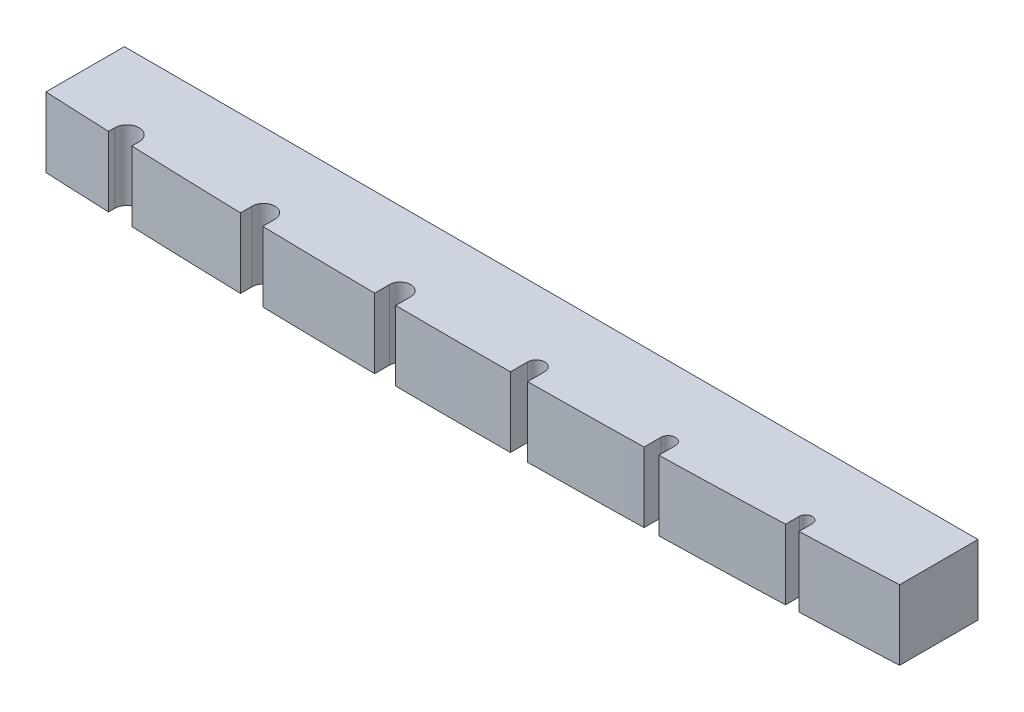
ISO-10303-21;
HEADER;
FILE_DESCRIPTION(('STEP AP214'),'2;1');
FILE_NAME('part.step','',(''),(''),'','','');
FILE_SCHEMA(('AUTOMOTIVE_DESIGN { 1 0 10303 214 1 1 1 1 }'));
ENDSEC;
DATA;
#1=APPLICATION_CONTEXT('core data for automotive mechanical design processes');
#2=APPLICATION_PROTOCOL_DEFINITION('international standard','automotive_design',2000,#1);
#3=PRODUCT_CONTEXT('',#1,'mechanical');
#4=PRODUCT('Part','Part','',(#3));
#5=PRODUCT_RELATED_PRODUCT_CATEGORY('part','',(#4));
#6=PRODUCT_DEFINITION_FORMATION('','',#4);
#7=PRODUCT_DEFINITION_CONTEXT('part definition',#1,'design');
#8=PRODUCT_DEFINITION('design','',#6,#7);
#9=PRODUCT_DEFINITION_SHAPE('','',#8);
#10=(LENGTH_UNIT() NAMED_UNIT(*) SI_UNIT(.MILLI.,.METRE.));
#11=(NAMED_UNIT(*) PLANE_ANGLE_UNIT() SI_UNIT($,.RADIAN.));
#12=(NAMED_UNIT(*) SI_UNIT($,.STERADIAN.) SOLID_ANGLE_UNIT());
#13=UNCERTAINTY_MEASURE_WITH_UNIT(LENGTH_MEASURE(1.E-05),#10,'distance_accuracy_value','');
#14=(GEOMETRIC_REPRESENTATION_CONTEXT(3) GLOBAL_UNCERTAINTY_ASSIGNED_CONTEXT((#13)) GLOBAL_UNIT_ASSIGNED_CONTEXT((#10,
#11,#12)) REPRESENTATION_CONTEXT('',''));
#15=CARTESIAN_POINT('',(0.,0.,0.));
#16=DIRECTION('',(0.,0.,1.));
#17=DIRECTION('',(1.,0.,0.));
#18=AXIS2_PLACEMENT_3D('',#15,#16,#17);
#19=CARTESIAN_POINT('',(0.,3.429,0.));
#20=DIRECTION('',(1.,0.,0.));
#21=DIRECTION('',(0.,0.,-1.));
#22=AXIS2_PLACEMENT_3D('',#19,#20,#21);
#23=PLANE('',#22);
#24=DIRECTION('',(0.,0.,1.));
#25=VECTOR('',#24,1.);
#26=CARTESIAN_POINT('',(0.,0.,0.));
#27=LINE('',#26,#25);
#28=CARTESIAN_POINT('',(0.,0.,-4.3561));
#29=VERTEX_POINT('',#28);
#30=CARTESIAN_POINT('',(0.,0.,-0.508));
#31=VERTEX_POINT('',#30);
#32=EDGE_CURVE('E229',#29,#31,#27,.T.);
#33=ORIENTED_EDGE('',*,*,#32,.T.);
#34=DIRECTION('',(0.,1.,0.));
#35=VECTOR('',#34,1.);
#36=CARTESIAN_POINT('',(0.,-0.00100000000000013,-0.508));
#37=LINE('',#36,#35);
#38=CARTESIAN_POINT('',(0.,3.429,-0.508));
#39=VERTEX_POINT('',#38);
#40=EDGE_CURVE('E215',#31,#39,#37,.T.);
#41=ORIENTED_EDGE('',*,*,#40,.T.);
#42=DIRECTION('',(0.,0.,1.));
#43=VECTOR('',#42,1.);
#44=CARTESIAN_POINT('',(0.,3.429,0.));
#45=LINE('',#44,#43);
#46=CARTESIAN_POINT('',(0.,3.429,-4.3561));
#47=VERTEX_POINT('',#46);
#48=EDGE_CURVE('E246',#47,#39,#45,.T.);
#49=ORIENTED_EDGE('',*,*,#48,.F.);
#50=DIRECTION('',(0.,-1.,0.));
#51=VECTOR('',#50,1.);
#52=CARTESIAN_POINT('',(0.,3.429,-4.3561));
#53=LINE('',#52,#51);
#54=EDGE_CURVE('E40',#47,#29,#53,.T.);
#55=ORIENTED_EDGE('',*,*,#54,.T.);
#56=EDGE_LOOP('',(#33,#41,#49,#55));
#57=FACE_BOUND('',#56,.T.);
#58=ADVANCED_FACE('F33',(#57),#23,.F.);
#59=CARTESIAN_POINT('',(41.91,3.429,0.));
#60=DIRECTION('',(-1.,0.,0.));
#61=DIRECTION('',(0.,0.,1.));
#62=AXIS2_PLACEMENT_3D('',#59,#60,#61);
#63=PLANE('',#62);
#64=DIRECTION('',(0.,0.,-1.));
#65=VECTOR('',#64,1.);
#66=CARTESIAN_POINT('',(41.91,3.429,0.));
#67=LINE('',#66,#65);
#68=CARTESIAN_POINT('',(41.91,3.429,-0.508));
#69=VERTEX_POINT('',#68);
#70=CARTESIAN_POINT('',(41.91,3.429,-4.3561));
#71=VERTEX_POINT('',#70);
#72=EDGE_CURVE('E247',#69,#71,#67,.T.);
#73=ORIENTED_EDGE('',*,*,#72,.F.);
#74=DIRECTION('',(0.,1.,0.));
#75=VECTOR('',#74,1.);
#76=CARTESIAN_POINT('',(41.91,-0.00100000000000013,-0.508));
#77=LINE('',#76,#75);
#78=CARTESIAN_POINT('',(41.91,0.,-0.508));
#79=VERTEX_POINT('',#78);
#80=EDGE_CURVE('E416',#79,#69,#77,.T.);
#81=ORIENTED_EDGE('',*,*,#80,.F.);
#82=DIRECTION('',(0.,0.,-1.));
#83=VECTOR('',#82,1.);
#84=CARTESIAN_POINT('',(41.91,0.,0.));
#85=LINE('',#84,#83);
#86=CARTESIAN_POINT('',(41.91,0.,-4.3561));
#87=VERTEX_POINT('',#86);
#88=EDGE_CURVE('E236',#79,#87,#85,.T.);
#89=ORIENTED_EDGE('',*,*,#88,.T.);
#90=DIRECTION('',(0.,-1.,0.));
#91=VECTOR('',#90,1.);
#92=CARTESIAN_POINT('',(41.91,3.429,-4.3561));
#93=LINE('',#92,#91);
#94=EDGE_CURVE('E11',#71,#87,#93,.T.);
#95=ORIENTED_EDGE('',*,*,#94,.F.);
#96=EDGE_LOOP('',(#73,#81,#89,#95));
#97=FACE_BOUND('',#96,.T.);
#98=ADVANCED_FACE('F537',(#97),#63,.F.);
#99=CARTESIAN_POINT('',(0.,3.429,-4.3561));
#100=DIRECTION('',(0.,0.,1.));
#101=DIRECTION('',(1.,0.,0.));
#102=AXIS2_PLACEMENT_3D('',#99,#100,#101);
#103=PLANE('',#102);
#104=DIRECTION('',(-1.,0.,0.));
#105=VECTOR('',#104,1.);
#106=CARTESIAN_POINT('',(0.,0.,-4.3561));
#107=LINE('',#106,#105);
#108=EDGE_CURVE('E238',#87,#29,#107,.T.);
#109=ORIENTED_EDGE('',*,*,#108,.T.);
#110=ORIENTED_EDGE('',*,*,#54,.F.);
#111=DIRECTION('',(-1.,0.,0.));
#112=VECTOR('',#111,1.);
#113=CARTESIAN_POINT('',(0.,3.429,-4.3561));
#114=LINE('',#113,#112);
#115=EDGE_CURVE('E243',#71,#47,#114,.T.);
#116=ORIENTED_EDGE('',*,*,#115,.F.);
#117=ORIENTED_EDGE('',*,*,#94,.T.);
#118=EDGE_LOOP('',(#109,#110,#116,#117));
#119=FACE_BOUND('',#118,.T.);
#120=ADVANCED_FACE('F539',(#119),#103,.F.);
#121=CARTESIAN_POINT('',(0.,3.429,0.));
#122=DIRECTION('',(0.,-1.,0.));
#123=DIRECTION('',(0.,0.,-1.));
#124=AXIS2_PLACEMENT_3D('',#121,#122,#123);
#125=PLANE('',#124);
#126=ORIENTED_EDGE('',*,*,#48,.T.);
#127=CARTESIAN_POINT('',(20.955,3.429,-432.450875000121));
#128=DIRECTION('',(0.,-1.,0.));
#129=DIRECTION('',(0.,0.,1.));
#130=AXIS2_PLACEMENT_3D('',#127,#128,#129);
#131=CIRCLE('',#130,432.45087500012);
#132=CARTESIAN_POINT('',(3.21310000000003,3.429,-0.364096363282662));
#133=VERTEX_POINT('',#132);
#134=EDGE_CURVE('E218',#133,#39,#131,.T.);
#135=ORIENTED_EDGE('',*,*,#134,.F.);
#136=DIRECTION('',(0.,0.,1.));
#137=VECTOR('',#136,1.);
#138=CARTESIAN_POINT('',(3.2131,3.429,0.));
#139=LINE('',#138,#137);
#140=CARTESIAN_POINT('',(3.21310000000005,3.429,-0.673406364672869));
#141=VERTEX_POINT('',#140);
#142=EDGE_CURVE('E263',#141,#133,#139,.T.);
#143=ORIENTED_EDGE('',*,*,#142,.F.);
#144=CARTESIAN_POINT('',(3.81000024084542,3.429,-0.673099759154534));
#145=DIRECTION('',(0.,1.,0.));
#146=DIRECTION('',(0.,0.,-1.));
#147=AXIS2_PLACEMENT_3D('',#144,#145,#146);
#148=CIRCLE('',#147,0.596900319591282);
#149=CARTESIAN_POINT('',(4.40690048169086,3.429,-0.672793153825247));
#150=VERTEX_POINT('',#149);
#151=EDGE_CURVE('E266',#150,#141,#148,.T.);
#152=ORIENTED_EDGE('',*,*,#151,.F.);
#153=DIRECTION('',(0.,0.,-1.));
#154=VECTOR('',#153,1.);
#155=CARTESIAN_POINT('',(4.40690048169084,3.429,0.));
#156=LINE('',#155,#154);
#157=CARTESIAN_POINT('',(4.40690048169084,3.429,-0.316729518995806));
#158=VERTEX_POINT('',#157);
#159=EDGE_CURVE('E264',#158,#150,#156,.T.);
#160=ORIENTED_EDGE('',*,*,#159,.F.);
#161=CARTESIAN_POINT('',(20.955,3.429,-432.450875000121));
#162=DIRECTION('',(0.,-1.,0.));
#163=DIRECTION('',(0.,0.,1.));
#164=AXIS2_PLACEMENT_3D('',#161,#162,#163);
#165=CIRCLE('',#164,432.45087500012);
#166=CARTESIAN_POINT('',(9.91870048169088,3.429,-0.140848073480859));
#167=VERTEX_POINT('',#166);
#168=EDGE_CURVE('E372',#167,#158,#165,.T.);
#169=ORIENTED_EDGE('',*,*,#168,.F.);
#170=DIRECTION('',(0.,0.,1.));
#171=VECTOR('',#170,1.);
#172=CARTESIAN_POINT('',(9.91870048169088,3.429,0.));
#173=LINE('',#172,#171);
#174=CARTESIAN_POINT('',(9.91870048169088,3.429,-0.7112));
#175=VERTEX_POINT('',#174);
#176=EDGE_CURVE('E284',#175,#167,#173,.T.);
#177=ORIENTED_EDGE('',*,*,#176,.F.);
#178=CARTESIAN_POINT('',(10.4775004816909,3.429,-0.7112));
#179=DIRECTION('',(0.,1.,0.));
#180=DIRECTION('',(0.,0.,-1.));
#181=AXIS2_PLACEMENT_3D('',#178,#179,#180);
#182=CIRCLE('',#181,0.5588);
#183=CARTESIAN_POINT('',(11.0363004816909,3.429,-0.7112));
#184=VERTEX_POINT('',#183);
#185=EDGE_CURVE('E287',#184,#175,#182,.T.);
#186=ORIENTED_EDGE('',*,*,#185,.F.);
#187=DIRECTION('',(0.,0.,-1.));
#188=VECTOR('',#187,1.);
#189=CARTESIAN_POINT('',(11.0363004816909,3.429,0.));
#190=LINE('',#189,#188);
#191=CARTESIAN_POINT('',(11.0363004816909,3.429,-0.113762681232032));
#192=VERTEX_POINT('',#191);
#193=EDGE_CURVE('E285',#192,#184,#190,.T.);
#194=ORIENTED_EDGE('',*,*,#193,.F.);
#195=CARTESIAN_POINT('',(20.955,3.429,-432.450875000121));
#196=DIRECTION('',(0.,-1.,0.));
#197=DIRECTION('',(0.,0.,1.));
#198=AXIS2_PLACEMENT_3D('',#195,#196,#197);
#199=CIRCLE('',#198,432.45087500012);
#200=CARTESIAN_POINT('',(16.6243004816909,3.429,-0.021685039438224));
#201=VERTEX_POINT('',#200);
#202=EDGE_CURVE('E393',#201,#192,#199,.T.);
#203=ORIENTED_EDGE('',*,*,#202,.F.);
#204=DIRECTION('',(0.,0.,1.));
#205=VECTOR('',#204,1.);
#206=CARTESIAN_POINT('',(16.6243004816909,3.429,0.));
#207=LINE('',#206,#205);
#208=CARTESIAN_POINT('',(16.6243004816909,3.429,-0.749300000000001));
#209=VERTEX_POINT('',#208);
#210=EDGE_CURVE('E305',#209,#201,#207,.T.);
#211=ORIENTED_EDGE('',*,*,#210,.F.);
#212=CARTESIAN_POINT('',(17.1450004816909,3.429,-0.749300000000001));
#213=DIRECTION('',(0.,1.,0.));
#214=DIRECTION('',(0.,0.,-1.));
#215=AXIS2_PLACEMENT_3D('',#212,#213,#214);
#216=CIRCLE('',#215,0.520699999999999);
#217=CARTESIAN_POINT('',(17.6657004816909,3.429,-0.749300000000001));
#218=VERTEX_POINT('',#217);
#219=EDGE_CURVE('E308',#218,#209,#216,.T.);
#220=ORIENTED_EDGE('',*,*,#219,.F.);
#221=DIRECTION('',(0.,0.,-1.));
#222=VECTOR('',#221,1.);
#223=CARTESIAN_POINT('',(17.6657004816909,3.429,0.));
#224=LINE('',#223,#222);
#225=CARTESIAN_POINT('',(17.6657004816909,3.429,-0.0125096842659156));
#226=VERTEX_POINT('',#225);
#227=EDGE_CURVE('E306',#226,#218,#224,.T.);
#228=ORIENTED_EDGE('',*,*,#227,.F.);
#229=CARTESIAN_POINT('',(20.955,3.429,-432.450875000121));
#230=DIRECTION('',(0.,-1.,0.));
#231=DIRECTION('',(0.,0.,1.));
#232=AXIS2_PLACEMENT_3D('',#229,#230,#231);
#233=CIRCLE('',#232,432.45087500012);
#234=CARTESIAN_POINT('',(23.3045004816909,3.429,-0.00638245124290338));
#235=VERTEX_POINT('',#234);
#236=EDGE_CURVE('E386',#235,#226,#233,.T.);
#237=ORIENTED_EDGE('',*,*,#236,.F.);
#238=DIRECTION('',(0.,0.,1.));
#239=VECTOR('',#238,1.);
#240=CARTESIAN_POINT('',(23.3045004816909,3.429,0.));
#241=LINE('',#240,#239);
#242=CARTESIAN_POINT('',(23.3045004816909,3.429,-0.850899999999998));
#243=VERTEX_POINT('',#242);
#244=EDGE_CURVE('E326',#243,#235,#241,.T.);
#245=ORIENTED_EDGE('',*,*,#244,.F.);
#246=CARTESIAN_POINT('',(23.7236004816909,3.429,-0.850899999999998));
#247=DIRECTION('',(0.,1.,0.));
#248=DIRECTION('',(0.,0.,-1.));
#249=AXIS2_PLACEMENT_3D('',#246,#247,#248);
#250=CIRCLE('',#249,0.419099999999999);
#251=CARTESIAN_POINT('',(24.1427004816909,3.429,-0.850899999999998));
#252=VERTEX_POINT('',#251);
#253=EDGE_CURVE('E329',#252,#243,#250,.T.);
#254=ORIENTED_EDGE('',*,*,#253,.F.);
#255=DIRECTION('',(0.,0.,-1.));
#256=VECTOR('',#255,1.);
#257=CARTESIAN_POINT('',(24.1427004816909,3.429,0.));
#258=LINE('',#257,#256);
#259=CARTESIAN_POINT('',(24.1427004816909,3.429,-0.0117488170139901));
#260=VERTEX_POINT('',#259);
#261=EDGE_CURVE('E327',#260,#252,#258,.T.);
#262=ORIENTED_EDGE('',*,*,#261,.F.);
#263=CARTESIAN_POINT('',(20.955,3.429,-432.450875000121));
#264=DIRECTION('',(0.,-1.,0.));
#265=DIRECTION('',(0.,0.,1.));
#266=AXIS2_PLACEMENT_3D('',#263,#264,#265);
#267=CIRCLE('',#266,432.45087500012);
#268=CARTESIAN_POINT('',(29.7815004816909,3.429,-0.0900856382538562));
#269=VERTEX_POINT('',#268);
#270=EDGE_CURVE('E405',#269,#260,#267,.T.);
#271=ORIENTED_EDGE('',*,*,#270,.F.);
#272=DIRECTION('',(0.,0.,1.));
#273=VECTOR('',#272,1.);
#274=CARTESIAN_POINT('',(29.7815004816909,3.429,0.));
#275=LINE('',#274,#273);
#276=CARTESIAN_POINT('',(29.7815004816909,3.429,-0.914400000000003));
#277=VERTEX_POINT('',#276);
#278=EDGE_CURVE('E347',#277,#269,#275,.T.);
#279=ORIENTED_EDGE('',*,*,#278,.F.);
#280=CARTESIAN_POINT('',(30.1371004816909,3.429,-0.914400000000003));
#281=DIRECTION('',(0.,1.,0.));
#282=DIRECTION('',(0.,0.,-1.));
#283=AXIS2_PLACEMENT_3D('',#280,#281,#282);
#284=CIRCLE('',#283,0.355599999999998);
#285=CARTESIAN_POINT('',(30.4927004816909,3.429,-0.914400000000003));
#286=VERTEX_POINT('',#285);
#287=EDGE_CURVE('E350',#286,#277,#284,.T.);
#288=ORIENTED_EDGE('',*,*,#287,.F.);
#289=DIRECTION('',(0.,0.,-1.));
#290=VECTOR('',#289,1.);
#291=CARTESIAN_POINT('',(30.4927004816909,3.429,0.));
#292=LINE('',#291,#290);
#293=CARTESIAN_POINT('',(30.4927004816909,3.429,-0.105189745958079));
#294=VERTEX_POINT('',#293);
#295=EDGE_CURVE('E348',#294,#286,#292,.T.);
#296=ORIENTED_EDGE('',*,*,#295,.F.);
#297=CARTESIAN_POINT('',(20.955,3.429,-432.450875000121));
#298=DIRECTION('',(0.,-1.,0.));
#299=DIRECTION('',(0.,0.,1.));
#300=AXIS2_PLACEMENT_3D('',#297,#298,#299);
#301=CIRCLE('',#300,432.45087500012);
#302=CARTESIAN_POINT('',(36.5379004816909,3.429,-0.280847694955066));
#303=VERTEX_POINT('',#302);
#304=EDGE_CURVE('E423',#303,#294,#301,.T.);
#305=ORIENTED_EDGE('',*,*,#304,.F.);
#306=DIRECTION('',(0.,0.,1.));
#307=VECTOR('',#306,1.);
#308=CARTESIAN_POINT('',(36.5379004816909,3.429,0.));
#309=LINE('',#308,#307);
#310=CARTESIAN_POINT('',(36.5379004816909,3.429,-0.952500000000002));
#311=VERTEX_POINT('',#310);
#312=EDGE_CURVE('E368',#311,#303,#309,.T.);
#313=ORIENTED_EDGE('',*,*,#312,.F.);
#314=CARTESIAN_POINT('',(36.8554004816909,3.429,-0.952500000000002));
#315=DIRECTION('',(0.,1.,0.));
#316=DIRECTION('',(0.,0.,-1.));
#317=AXIS2_PLACEMENT_3D('',#314,#315,#316);
#318=CIRCLE('',#317,0.317500000000005);
#319=CARTESIAN_POINT('',(37.1729004816909,3.429,-0.952500000000002));
#320=VERTEX_POINT('',#319);
#321=EDGE_CURVE('E371',#320,#311,#318,.T.);
#322=ORIENTED_EDGE('',*,*,#321,.F.);
#323=DIRECTION('',(0.,0.,-1.));
#324=VECTOR('',#323,1.);
#325=CARTESIAN_POINT('',(37.1729004816909,3.429,0.));
#326=LINE('',#325,#324);
#327=CARTESIAN_POINT('',(37.1729004816909,3.429,-0.304211247713848));
#328=VERTEX_POINT('',#327);
#329=EDGE_CURVE('E369',#328,#320,#326,.T.);
#330=ORIENTED_EDGE('',*,*,#329,.F.);
#331=CARTESIAN_POINT('',(20.955,3.429,-432.450875000121));
#332=DIRECTION('',(0.,-1.,0.));
#333=DIRECTION('',(0.,0.,1.));
#334=AXIS2_PLACEMENT_3D('',#331,#332,#333);
#335=CIRCLE('',#334,432.45087500012);
#336=EDGE_CURVE('E417',#69,#328,#335,.T.);
#337=ORIENTED_EDGE('',*,*,#336,.F.);
#338=ORIENTED_EDGE('',*,*,#72,.T.);
#339=ORIENTED_EDGE('',*,*,#115,.T.);
#340=EDGE_LOOP('',(#126,#135,#143,#152,#160,#169,#177,#186,#194,#203,#211,#220,#228,#237,#245,
#254,#262,#271,#279,#288,#296,#305,#313,#322,#330,#337,#338,#339));
#341=FACE_BOUND('',#340,.T.);
#342=ADVANCED_FACE('F432',(#341),#125,.F.);
#343=CARTESIAN_POINT('',(0.,0.,0.));
#344=DIRECTION('',(0.,-1.,0.));
#345=DIRECTION('',(0.,0.,-1.));
#346=AXIS2_PLACEMENT_3D('',#343,#344,#345);
#347=PLANE('',#346);
#348=CARTESIAN_POINT('',(20.955,0.,-432.450875000121));
#349=DIRECTION('',(0.,-1.,0.));
#350=DIRECTION('',(0.,0.,-1.));
#351=AXIS2_PLACEMENT_3D('',#348,#349,#350);
#352=CIRCLE('',#351,432.45087500012);
#353=CARTESIAN_POINT('',(3.21310000000003,0.,-0.364096363282718));
#354=VERTEX_POINT('',#353);
#355=EDGE_CURVE('E47',#354,#31,#352,.T.);
#356=ORIENTED_EDGE('',*,*,#355,.T.);
#357=ORIENTED_EDGE('',*,*,#32,.F.);
#358=ORIENTED_EDGE('',*,*,#108,.F.);
#359=ORIENTED_EDGE('',*,*,#88,.F.);
#360=CARTESIAN_POINT('',(20.955,0.,-432.450875000121));
#361=DIRECTION('',(0.,-1.,0.));
#362=DIRECTION('',(0.,0.,-1.));
#363=AXIS2_PLACEMENT_3D('',#360,#361,#362);
#364=CIRCLE('',#363,432.45087500012);
#365=CARTESIAN_POINT('',(37.1729004816909,0.,-0.304211247713848));
#366=VERTEX_POINT('',#365);
#367=EDGE_CURVE('E413',#79,#366,#364,.T.);
#368=ORIENTED_EDGE('',*,*,#367,.T.);
#369=DIRECTION('',(0.,0.,-1.));
#370=VECTOR('',#369,1.);
#371=CARTESIAN_POINT('',(37.1729004816909,0.,0.));
#372=LINE('',#371,#370);
#373=CARTESIAN_POINT('',(37.1729004816909,0.,-0.952500000000002));
#374=VERTEX_POINT('',#373);
#375=EDGE_CURVE('E360',#366,#374,#372,.T.);
#376=ORIENTED_EDGE('',*,*,#375,.T.);
#377=CARTESIAN_POINT('',(36.8554004816909,0.,-0.952500000000002));
#378=DIRECTION('',(0.,-1.,0.));
#379=DIRECTION('',(0.,0.,-1.));
#380=AXIS2_PLACEMENT_3D('',#377,#378,#379);
#381=CIRCLE('',#380,0.317500000000005);
#382=CARTESIAN_POINT('',(36.5379004816909,0.,-0.952500000000002));
#383=VERTEX_POINT('',#382);
#384=EDGE_CURVE('E359',#374,#383,#381,.F.);
#385=ORIENTED_EDGE('',*,*,#384,.T.);
#386=DIRECTION('',(0.,0.,1.));
#387=VECTOR('',#386,1.);
#388=CARTESIAN_POINT('',(36.5379004816909,0.,0.));
#389=LINE('',#388,#387);
#390=CARTESIAN_POINT('',(36.5379004816909,0.,-0.280847694955122));
#391=VERTEX_POINT('',#390);
#392=EDGE_CURVE('E351',#383,#391,#389,.T.);
#393=ORIENTED_EDGE('',*,*,#392,.T.);
#394=CARTESIAN_POINT('',(20.955,0.,-432.450875000121));
#395=DIRECTION('',(0.,-1.,0.));
#396=DIRECTION('',(0.,0.,-1.));
#397=AXIS2_PLACEMENT_3D('',#394,#395,#396);
#398=CIRCLE('',#397,432.45087500012);
#399=CARTESIAN_POINT('',(30.4927004816909,0.,-0.105189745958079));
#400=VERTEX_POINT('',#399);
#401=EDGE_CURVE('E55',#391,#400,#398,.T.);
#402=ORIENTED_EDGE('',*,*,#401,.T.);
#403=DIRECTION('',(0.,0.,-1.));
#404=VECTOR('',#403,1.);
#405=CARTESIAN_POINT('',(30.4927004816909,0.,0.));
#406=LINE('',#405,#404);
#407=CARTESIAN_POINT('',(30.4927004816909,0.,-0.914400000000003));
#408=VERTEX_POINT('',#407);
#409=EDGE_CURVE('E339',#400,#408,#406,.T.);
#410=ORIENTED_EDGE('',*,*,#409,.T.);
#411=CARTESIAN_POINT('',(30.1371004816909,0.,-0.914400000000003));
#412=DIRECTION('',(0.,-1.,0.));
#413=DIRECTION('',(0.,0.,-1.));
#414=AXIS2_PLACEMENT_3D('',#411,#412,#413);
#415=CIRCLE('',#414,0.355599999999998);
#416=CARTESIAN_POINT('',(29.7815004816909,0.,-0.914400000000003));
#417=VERTEX_POINT('',#416);
#418=EDGE_CURVE('E338',#408,#417,#415,.F.);
#419=ORIENTED_EDGE('',*,*,#418,.T.);
#420=DIRECTION('',(0.,0.,1.));
#421=VECTOR('',#420,1.);
#422=CARTESIAN_POINT('',(29.7815004816909,0.,0.));
#423=LINE('',#422,#421);
#424=CARTESIAN_POINT('',(29.7815004816909,0.,-0.0900856382539117));
#425=VERTEX_POINT('',#424);
#426=EDGE_CURVE('E330',#417,#425,#423,.T.);
#427=ORIENTED_EDGE('',*,*,#426,.T.);
#428=CARTESIAN_POINT('',(20.955,0.,-432.450875000121));
#429=DIRECTION('',(0.,-1.,0.));
#430=DIRECTION('',(0.,0.,-1.));
#431=AXIS2_PLACEMENT_3D('',#428,#429,#430);
#432=CIRCLE('',#431,432.45087500012);
#433=CARTESIAN_POINT('',(24.1427004816909,0.,-0.0117488170139901));
#434=VERTEX_POINT('',#433);
#435=EDGE_CURVE('E404',#425,#434,#432,.T.);
#436=ORIENTED_EDGE('',*,*,#435,.T.);
#437=DIRECTION('',(0.,0.,-1.));
#438=VECTOR('',#437,1.);
#439=CARTESIAN_POINT('',(24.1427004816909,0.,0.));
#440=LINE('',#439,#438);
#441=CARTESIAN_POINT('',(24.1427004816909,0.,-0.850899999999998));
#442=VERTEX_POINT('',#441);
#443=EDGE_CURVE('E318',#434,#442,#440,.T.);
#444=ORIENTED_EDGE('',*,*,#443,.T.);
#445=CARTESIAN_POINT('',(23.7236004816909,0.,-0.850899999999998));
#446=DIRECTION('',(0.,-1.,0.));
#447=DIRECTION('',(0.,0.,-1.));
#448=AXIS2_PLACEMENT_3D('',#445,#446,#447);
#449=CIRCLE('',#448,0.419099999999999);
#450=CARTESIAN_POINT('',(23.3045004816909,0.,-0.850899999999998));
#451=VERTEX_POINT('',#450);
#452=EDGE_CURVE('E317',#442,#451,#449,.F.);
#453=ORIENTED_EDGE('',*,*,#452,.T.);
#454=DIRECTION('',(0.,0.,1.));
#455=VECTOR('',#454,1.);
#456=CARTESIAN_POINT('',(23.3045004816909,0.,0.));
#457=LINE('',#456,#455);
#458=CARTESIAN_POINT('',(23.3045004816909,0.,-0.00638245124295889));
#459=VERTEX_POINT('',#458);
#460=EDGE_CURVE('E309',#451,#459,#457,.T.);
#461=ORIENTED_EDGE('',*,*,#460,.T.);
#462=CARTESIAN_POINT('',(20.955,0.,-432.450875000121));
#463=DIRECTION('',(0.,-1.,0.));
#464=DIRECTION('',(0.,0.,-1.));
#465=AXIS2_PLACEMENT_3D('',#462,#463,#464);
#466=CIRCLE('',#465,432.45087500012);
#467=CARTESIAN_POINT('',(17.6657004816909,0.,-0.0125096842659156));
#468=VERTEX_POINT('',#467);
#469=EDGE_CURVE('E385',#459,#468,#466,.T.);
#470=ORIENTED_EDGE('',*,*,#469,.T.);
#471=DIRECTION('',(0.,0.,-1.));
#472=VECTOR('',#471,1.);
#473=CARTESIAN_POINT('',(17.6657004816909,0.,0.));
#474=LINE('',#473,#472);
#475=CARTESIAN_POINT('',(17.6657004816909,0.,-0.749300000000001));
#476=VERTEX_POINT('',#475);
#477=EDGE_CURVE('E297',#468,#476,#474,.T.);
#478=ORIENTED_EDGE('',*,*,#477,.T.);
#479=CARTESIAN_POINT('',(17.1450004816909,0.,-0.749300000000001));
#480=DIRECTION('',(0.,-1.,0.));
#481=DIRECTION('',(0.,0.,-1.));
#482=AXIS2_PLACEMENT_3D('',#479,#480,#481);
#483=CIRCLE('',#482,0.520699999999999);
#484=CARTESIAN_POINT('',(16.6243004816909,0.,-0.749300000000001));
#485=VERTEX_POINT('',#484);
#486=EDGE_CURVE('E296',#476,#485,#483,.F.);
#487=ORIENTED_EDGE('',*,*,#486,.T.);
#488=DIRECTION('',(0.,0.,1.));
#489=VECTOR('',#488,1.);
#490=CARTESIAN_POINT('',(16.6243004816909,0.,0.));
#491=LINE('',#490,#489);
#492=CARTESIAN_POINT('',(16.6243004816909,0.,-0.0216850394382795));
#493=VERTEX_POINT('',#492);
#494=EDGE_CURVE('E288',#485,#493,#491,.T.);
#495=ORIENTED_EDGE('',*,*,#494,.T.);
#496=CARTESIAN_POINT('',(20.955,0.,-432.450875000121));
#497=DIRECTION('',(0.,-1.,0.));
#498=DIRECTION('',(0.,0.,-1.));
#499=AXIS2_PLACEMENT_3D('',#496,#497,#498);
#500=CIRCLE('',#499,432.45087500012);
#501=CARTESIAN_POINT('',(11.0363004816909,0.,-0.113762681232032));
#502=VERTEX_POINT('',#501);
#503=EDGE_CURVE('E392',#493,#502,#500,.T.);
#504=ORIENTED_EDGE('',*,*,#503,.T.);
#505=DIRECTION('',(0.,0.,-1.));
#506=VECTOR('',#505,1.);
#507=CARTESIAN_POINT('',(11.0363004816909,0.,0.));
#508=LINE('',#507,#506);
#509=CARTESIAN_POINT('',(11.0363004816909,0.,-0.7112));
#510=VERTEX_POINT('',#509);
#511=EDGE_CURVE('E276',#502,#510,#508,.T.);
#512=ORIENTED_EDGE('',*,*,#511,.T.);
#513=CARTESIAN_POINT('',(10.4775004816909,0.,-0.7112));
#514=DIRECTION('',(0.,-1.,0.));
#515=DIRECTION('',(0.,0.,-1.));
#516=AXIS2_PLACEMENT_3D('',#513,#514,#515);
#517=CIRCLE('',#516,0.5588);
#518=CARTESIAN_POINT('',(9.91870048169088,0.,-0.7112));
#519=VERTEX_POINT('',#518);
#520=EDGE_CURVE('E275',#510,#519,#517,.F.);
#521=ORIENTED_EDGE('',*,*,#520,.T.);
#522=DIRECTION('',(0.,0.,1.));
#523=VECTOR('',#522,1.);
#524=CARTESIAN_POINT('',(9.91870048169088,0.,0.));
#525=LINE('',#524,#523);
#526=CARTESIAN_POINT('',(9.91870048169088,0.,-0.140848073480915));
#527=VERTEX_POINT('',#526);
#528=EDGE_CURVE('E267',#519,#527,#525,.T.);
#529=ORIENTED_EDGE('',*,*,#528,.T.);
#530=CARTESIAN_POINT('',(20.955,0.,-432.450875000121));
#531=DIRECTION('',(0.,-1.,0.));
#532=DIRECTION('',(0.,0.,-1.));
#533=AXIS2_PLACEMENT_3D('',#530,#531,#532);
#534=CIRCLE('',#533,432.45087500012);
#535=CARTESIAN_POINT('',(4.40690048169084,0.,-0.316729518995806));
#536=VERTEX_POINT('',#535);
#537=EDGE_CURVE('E378',#527,#536,#534,.T.);
#538=ORIENTED_EDGE('',*,*,#537,.T.);
#539=DIRECTION('',(0.,0.,-1.));
#540=VECTOR('',#539,1.);
#541=CARTESIAN_POINT('',(4.40690048169084,0.,0.));
#542=LINE('',#541,#540);
#543=CARTESIAN_POINT('',(4.40690048169086,0.,-0.672793153825247));
#544=VERTEX_POINT('',#543);
#545=EDGE_CURVE('E259',#536,#544,#542,.T.);
#546=ORIENTED_EDGE('',*,*,#545,.T.);
#547=CARTESIAN_POINT('',(3.81000024084542,0.,-0.673099759154534));
#548=DIRECTION('',(0.,-1.,0.));
#549=DIRECTION('',(0.,0.,-1.));
#550=AXIS2_PLACEMENT_3D('',#547,#548,#549);
#551=CIRCLE('',#550,0.596900319591282);
#552=CARTESIAN_POINT('',(3.21310000000007,0.,-0.673406364672869));
#553=VERTEX_POINT('',#552);
#554=EDGE_CURVE('E258',#544,#553,#551,.F.);
#555=ORIENTED_EDGE('',*,*,#554,.T.);
#556=DIRECTION('',(0.,0.,1.));
#557=VECTOR('',#556,1.);
#558=CARTESIAN_POINT('',(3.2131,0.,0.));
#559=LINE('',#558,#557);
#560=EDGE_CURVE('E231',#553,#354,#559,.T.);
#561=ORIENTED_EDGE('',*,*,#560,.T.);
#562=EDGE_LOOP('',(#356,#357,#358,#359,#368,#376,#385,#393,#402,#410,#419,#427,#436,#444,#453,
#461,#470,#478,#487,#495,#504,#512,#521,#529,#538,#546,#555,#561));
#563=FACE_BOUND('',#562,.T.);
#564=ADVANCED_FACE('F227',(#563),#347,.T.);
#565=CARTESIAN_POINT('',(4.40690048169084,-1.74300314919777,0.));
#566=DIRECTION('',(1.,0.,0.));
#567=DIRECTION('',(0.,0.,-1.));
#568=AXIS2_PLACEMENT_3D('',#565,#566,#567);
#569=PLANE('',#568);
#570=ORIENTED_EDGE('',*,*,#545,.F.);
#571=DIRECTION('',(0.,1.,0.));
#572=VECTOR('',#571,1.);
#573=CARTESIAN_POINT('',(4.40690048169084,-0.00100000000000013,-0.316729518995862));
#574=LINE('',#573,#572);
#575=EDGE_CURVE('E381',#158,#536,#574,.F.);
#576=ORIENTED_EDGE('',*,*,#575,.F.);
#577=ORIENTED_EDGE('',*,*,#159,.T.);
#578=DIRECTION('',(0.,1.,0.));
#579=VECTOR('',#578,1.);
#580=CARTESIAN_POINT('',(4.40690048169086,-1.74300314919777,-0.672793153825247));
#581=LINE('',#580,#579);
#582=EDGE_CURVE('E255',#544,#150,#581,.T.);
#583=ORIENTED_EDGE('',*,*,#582,.F.);
#584=EDGE_LOOP('',(#570,#576,#577,#583));
#585=FACE_BOUND('',#584,.T.);
#586=ADVANCED_FACE('F446',(#585),#569,.F.);
#587=CARTESIAN_POINT('',(3.81000024084542,-1.74300314919777,-0.673099759154534));
#588=DIRECTION('',(0.,1.,0.));
#589=DIRECTION('',(0.,0.,1.));
#590=AXIS2_PLACEMENT_3D('',#587,#588,#589);
#591=CYLINDRICAL_SURFACE('',#590,0.596900319591282);
#592=ORIENTED_EDGE('',*,*,#582,.T.);
#593=ORIENTED_EDGE('',*,*,#151,.T.);
#594=DIRECTION('',(0.,1.,0.));
#595=VECTOR('',#594,1.);
#596=CARTESIAN_POINT('',(3.21310000000005,-1.74300314919777,-0.673406364672869));
#597=LINE('',#596,#595);
#598=EDGE_CURVE('E240',#553,#141,#597,.T.);
#599=ORIENTED_EDGE('',*,*,#598,.F.);
#600=ORIENTED_EDGE('',*,*,#554,.F.);
#601=EDGE_LOOP('',(#592,#593,#599,#600));
#602=FACE_BOUND('',#601,.T.);
#603=ADVANCED_FACE('F438',(#602),#591,.F.);
#604=CARTESIAN_POINT('',(3.2131,-1.74300314919777,0.));
#605=DIRECTION('',(-1.,0.,0.));
#606=DIRECTION('',(0.,0.,1.));
#607=AXIS2_PLACEMENT_3D('',#604,#605,#606);
#608=PLANE('',#607);
#609=ORIENTED_EDGE('',*,*,#142,.T.);
#610=DIRECTION('',(0.,1.,0.));
#611=VECTOR('',#610,1.);
#612=CARTESIAN_POINT('',(3.21310000000003,-0.00100000000000013,-0.364096363282718));
#613=LINE('',#612,#611);
#614=EDGE_CURVE('E232',#354,#133,#613,.T.);
#615=ORIENTED_EDGE('',*,*,#614,.F.);
#616=ORIENTED_EDGE('',*,*,#560,.F.);
#617=ORIENTED_EDGE('',*,*,#598,.T.);
#618=EDGE_LOOP('',(#609,#615,#616,#617));
#619=FACE_BOUND('',#618,.T.);
#620=ADVANCED_FACE('F434',(#619),#608,.F.);
#621=CARTESIAN_POINT('',(11.0363004816909,-1.74300314919777,0.));
#622=DIRECTION('',(1.,0.,0.));
#623=DIRECTION('',(0.,0.,-1.));
#624=AXIS2_PLACEMENT_3D('',#621,#622,#623);
#625=PLANE('',#624);
#626=ORIENTED_EDGE('',*,*,#511,.F.);
#627=DIRECTION('',(0.,1.,0.));
#628=VECTOR('',#627,1.);
#629=CARTESIAN_POINT('',(11.0363004816909,-0.00100000000000013,-0.113762681232088));
#630=LINE('',#629,#628);
#631=EDGE_CURVE('E399',#192,#502,#630,.F.);
#632=ORIENTED_EDGE('',*,*,#631,.F.);
#633=ORIENTED_EDGE('',*,*,#193,.T.);
#634=DIRECTION('',(0.,1.,0.));
#635=VECTOR('',#634,1.);
#636=CARTESIAN_POINT('',(11.0363004816909,-1.74300314919777,-0.7112));
#637=LINE('',#636,#635);
#638=EDGE_CURVE('E272',#510,#184,#637,.T.);
#639=ORIENTED_EDGE('',*,*,#638,.F.);
#640=EDGE_LOOP('',(#626,#632,#633,#639));
#641=FACE_BOUND('',#640,.T.);
#642=ADVANCED_FACE('F464',(#641),#625,.F.);
#643=CARTESIAN_POINT('',(10.4775004816909,-1.74300314919777,-0.7112));
#644=DIRECTION('',(0.,1.,0.));
#645=DIRECTION('',(0.,0.,1.));
#646=AXIS2_PLACEMENT_3D('',#643,#644,#645);
#647=CYLINDRICAL_SURFACE('',#646,0.5588);
#648=ORIENTED_EDGE('',*,*,#638,.T.);
#649=ORIENTED_EDGE('',*,*,#185,.T.);
#650=DIRECTION('',(0.,1.,0.));
#651=VECTOR('',#650,1.);
#652=CARTESIAN_POINT('',(9.91870048169088,-1.74300314919777,-0.7112));
#653=LINE('',#652,#651);
#654=EDGE_CURVE('E277',#519,#175,#653,.T.);
#655=ORIENTED_EDGE('',*,*,#654,.F.);
#656=ORIENTED_EDGE('',*,*,#520,.F.);
#657=EDGE_LOOP('',(#648,#649,#655,#656));
#658=FACE_BOUND('',#657,.T.);
#659=ADVANCED_FACE('F455',(#658),#647,.F.);
#660=CARTESIAN_POINT('',(9.91870048169088,-1.74300314919777,0.));
#661=DIRECTION('',(-1.,0.,0.));
#662=DIRECTION('',(0.,0.,1.));
#663=AXIS2_PLACEMENT_3D('',#660,#661,#662);
#664=PLANE('',#663);
#665=ORIENTED_EDGE('',*,*,#176,.T.);
#666=DIRECTION('',(0.,1.,0.));
#667=VECTOR('',#666,1.);
#668=CARTESIAN_POINT('',(9.91870048169088,-0.00100000000000013,-0.140848073480915));
#669=LINE('',#668,#667);
#670=EDGE_CURVE('E383',#527,#167,#669,.T.);
#671=ORIENTED_EDGE('',*,*,#670,.F.);
#672=ORIENTED_EDGE('',*,*,#528,.F.);
#673=ORIENTED_EDGE('',*,*,#654,.T.);
#674=EDGE_LOOP('',(#665,#671,#672,#673));
#675=FACE_BOUND('',#674,.T.);
#676=ADVANCED_FACE('F453',(#675),#664,.F.);
#677=CARTESIAN_POINT('',(17.6657004816909,-1.74300314919777,0.));
#678=DIRECTION('',(1.,0.,0.));
#679=DIRECTION('',(0.,0.,-1.));
#680=AXIS2_PLACEMENT_3D('',#677,#678,#679);
#681=PLANE('',#680);
#682=ORIENTED_EDGE('',*,*,#477,.F.);
#683=DIRECTION('',(0.,1.,0.));
#684=VECTOR('',#683,1.);
#685=CARTESIAN_POINT('',(17.6657004816909,-0.00100000000000013,-0.0125096842659156));
#686=LINE('',#685,#684);
#687=EDGE_CURVE('E388',#226,#468,#686,.F.);
#688=ORIENTED_EDGE('',*,*,#687,.F.);
#689=ORIENTED_EDGE('',*,*,#227,.T.);
#690=DIRECTION('',(0.,1.,0.));
#691=VECTOR('',#690,1.);
#692=CARTESIAN_POINT('',(17.6657004816909,-1.74300314919777,-0.749300000000001));
#693=LINE('',#692,#691);
#694=EDGE_CURVE('E293',#476,#218,#693,.T.);
#695=ORIENTED_EDGE('',*,*,#694,.F.);
#696=EDGE_LOOP('',(#682,#688,#689,#695));
#697=FACE_BOUND('',#696,.T.);
#698=ADVANCED_FACE('F481',(#697),#681,.F.);
#699=CARTESIAN_POINT('',(17.1450004816909,-1.74300314919777,-0.749300000000001));
#700=DIRECTION('',(0.,1.,0.));
#701=DIRECTION('',(0.,0.,1.));
#702=AXIS2_PLACEMENT_3D('',#699,#700,#701);
#703=CYLINDRICAL_SURFACE('',#702,0.520699999999999);
#704=ORIENTED_EDGE('',*,*,#694,.T.);
#705=ORIENTED_EDGE('',*,*,#219,.T.);
#706=DIRECTION('',(0.,1.,0.));
#707=VECTOR('',#706,1.);
#708=CARTESIAN_POINT('',(16.6243004816909,-1.74300314919777,-0.749300000000001));
#709=LINE('',#708,#707);
#710=EDGE_CURVE('E298',#485,#209,#709,.T.);
#711=ORIENTED_EDGE('',*,*,#710,.F.);
#712=ORIENTED_EDGE('',*,*,#486,.F.);
#713=EDGE_LOOP('',(#704,#705,#711,#712));
#714=FACE_BOUND('',#713,.T.);
#715=ADVANCED_FACE('F473',(#714),#703,.F.);
#716=CARTESIAN_POINT('',(16.6243004816909,-1.74300314919777,0.));
#717=DIRECTION('',(-1.,0.,0.));
#718=DIRECTION('',(0.,0.,1.));
#719=AXIS2_PLACEMENT_3D('',#716,#717,#718);
#720=PLANE('',#719);
#721=ORIENTED_EDGE('',*,*,#210,.T.);
#722=DIRECTION('',(0.,1.,0.));
#723=VECTOR('',#722,1.);
#724=CARTESIAN_POINT('',(16.6243004816909,-0.00100000000000013,-0.0216850394382795));
#725=LINE('',#724,#723);
#726=EDGE_CURVE('E395',#493,#201,#725,.T.);
#727=ORIENTED_EDGE('',*,*,#726,.F.);
#728=ORIENTED_EDGE('',*,*,#494,.F.);
#729=ORIENTED_EDGE('',*,*,#710,.T.);
#730=EDGE_LOOP('',(#721,#727,#728,#729));
#731=FACE_BOUND('',#730,.T.);
#732=ADVANCED_FACE('F471',(#731),#720,.F.);
#733=CARTESIAN_POINT('',(24.1427004816909,-1.74300314919777,0.));
#734=DIRECTION('',(1.,0.,0.));
#735=DIRECTION('',(0.,0.,-1.));
#736=AXIS2_PLACEMENT_3D('',#733,#734,#735);
#737=PLANE('',#736);
#738=ORIENTED_EDGE('',*,*,#443,.F.);
#739=DIRECTION('',(0.,1.,0.));
#740=VECTOR('',#739,1.);
#741=CARTESIAN_POINT('',(24.1427004816909,-0.00100000000000013,-0.0117488170140456));
#742=LINE('',#741,#740);
#743=EDGE_CURVE('E411',#260,#434,#742,.F.);
#744=ORIENTED_EDGE('',*,*,#743,.F.);
#745=ORIENTED_EDGE('',*,*,#261,.T.);
#746=DIRECTION('',(0.,1.,0.));
#747=VECTOR('',#746,1.);
#748=CARTESIAN_POINT('',(24.1427004816909,-1.74300314919777,-0.850899999999998));
#749=LINE('',#748,#747);
#750=EDGE_CURVE('E314',#442,#252,#749,.T.);
#751=ORIENTED_EDGE('',*,*,#750,.F.);
#752=EDGE_LOOP('',(#738,#744,#745,#751));
#753=FACE_BOUND('',#752,.T.);
#754=ADVANCED_FACE('F499',(#753),#737,.F.);
#755=CARTESIAN_POINT('',(23.7236004816909,-1.74300314919777,-0.850899999999998));
#756=DIRECTION('',(0.,1.,0.));
#757=DIRECTION('',(0.,0.,1.));
#758=AXIS2_PLACEMENT_3D('',#755,#756,#757);
#759=CYLINDRICAL_SURFACE('',#758,0.419099999999999);
#760=ORIENTED_EDGE('',*,*,#750,.T.);
#761=ORIENTED_EDGE('',*,*,#253,.T.);
#762=DIRECTION('',(0.,1.,0.));
#763=VECTOR('',#762,1.);
#764=CARTESIAN_POINT('',(23.3045004816909,-1.74300314919777,-0.850899999999998));
#765=LINE('',#764,#763);
#766=EDGE_CURVE('E319',#451,#243,#765,.T.);
#767=ORIENTED_EDGE('',*,*,#766,.F.);
#768=ORIENTED_EDGE('',*,*,#452,.F.);
#769=EDGE_LOOP('',(#760,#761,#767,#768));
#770=FACE_BOUND('',#769,.T.);
#771=ADVANCED_FACE('F490',(#770),#759,.F.);
#772=CARTESIAN_POINT('',(23.3045004816909,-1.74300314919777,0.));
#773=DIRECTION('',(-1.,0.,0.));
#774=DIRECTION('',(0.,0.,1.));
#775=AXIS2_PLACEMENT_3D('',#772,#773,#774);
#776=PLANE('',#775);
#777=ORIENTED_EDGE('',*,*,#244,.T.);
#778=DIRECTION('',(0.,1.,0.));
#779=VECTOR('',#778,1.);
#780=CARTESIAN_POINT('',(23.3045004816909,-0.00100000000000013,-0.00638245124295889));
#781=LINE('',#780,#779);
#782=EDGE_CURVE('E401',#459,#235,#781,.T.);
#783=ORIENTED_EDGE('',*,*,#782,.F.);
#784=ORIENTED_EDGE('',*,*,#460,.F.);
#785=ORIENTED_EDGE('',*,*,#766,.T.);
#786=EDGE_LOOP('',(#777,#783,#784,#785));
#787=FACE_BOUND('',#786,.T.);
#788=ADVANCED_FACE('F488',(#787),#776,.F.);
#789=CARTESIAN_POINT('',(30.4927004816909,-1.74300314919777,0.));
#790=DIRECTION('',(1.,0.,0.));
#791=DIRECTION('',(0.,0.,-1.));
#792=AXIS2_PLACEMENT_3D('',#789,#790,#791);
#793=PLANE('',#792);
#794=ORIENTED_EDGE('',*,*,#409,.F.);
#795=DIRECTION('',(0.,1.,0.));
#796=VECTOR('',#795,1.);
#797=CARTESIAN_POINT('',(30.4927004816909,-0.00100000000000013,-0.105189745958134));
#798=LINE('',#797,#796);
#799=EDGE_CURVE('E427',#294,#400,#798,.F.);
#800=ORIENTED_EDGE('',*,*,#799,.F.);
#801=ORIENTED_EDGE('',*,*,#295,.T.);
#802=DIRECTION('',(0.,1.,0.));
#803=VECTOR('',#802,1.);
#804=CARTESIAN_POINT('',(30.4927004816909,-1.74300314919777,-0.914400000000003));
#805=LINE('',#804,#803);
#806=EDGE_CURVE('E335',#408,#286,#805,.T.);
#807=ORIENTED_EDGE('',*,*,#806,.F.);
#808=EDGE_LOOP('',(#794,#800,#801,#807));
#809=FACE_BOUND('',#808,.T.);
#810=ADVANCED_FACE('F517',(#809),#793,.F.);
#811=CARTESIAN_POINT('',(30.1371004816909,-1.74300314919777,-0.914400000000003));
#812=DIRECTION('',(0.,1.,0.));
#813=DIRECTION('',(0.,0.,1.));
#814=AXIS2_PLACEMENT_3D('',#811,#812,#813);
#815=CYLINDRICAL_SURFACE('',#814,0.355599999999998);
#816=ORIENTED_EDGE('',*,*,#806,.T.);
#817=ORIENTED_EDGE('',*,*,#287,.T.);
#818=DIRECTION('',(0.,1.,0.));
#819=VECTOR('',#818,1.);
#820=CARTESIAN_POINT('',(29.7815004816909,-1.74300314919777,-0.914400000000003));
#821=LINE('',#820,#819);
#822=EDGE_CURVE('E340',#417,#277,#821,.T.);
#823=ORIENTED_EDGE('',*,*,#822,.F.);
#824=ORIENTED_EDGE('',*,*,#418,.F.);
#825=EDGE_LOOP('',(#816,#817,#823,#824));
#826=FACE_BOUND('',#825,.T.);
#827=ADVANCED_FACE('F508',(#826),#815,.F.);
#828=CARTESIAN_POINT('',(29.7815004816909,-1.74300314919777,0.));
#829=DIRECTION('',(-1.,0.,0.));
#830=DIRECTION('',(0.,0.,1.));
#831=AXIS2_PLACEMENT_3D('',#828,#829,#830);
#832=PLANE('',#831);
#833=ORIENTED_EDGE('',*,*,#278,.T.);
#834=DIRECTION('',(0.,1.,0.));
#835=VECTOR('',#834,1.);
#836=CARTESIAN_POINT('',(29.7815004816909,-0.00100000000000013,-0.0900856382539117));
#837=LINE('',#836,#835);
#838=EDGE_CURVE('E407',#425,#269,#837,.T.);
#839=ORIENTED_EDGE('',*,*,#838,.F.);
#840=ORIENTED_EDGE('',*,*,#426,.F.);
#841=ORIENTED_EDGE('',*,*,#822,.T.);
#842=EDGE_LOOP('',(#833,#839,#840,#841));
#843=FACE_BOUND('',#842,.T.);
#844=ADVANCED_FACE('F506',(#843),#832,.F.);
#845=CARTESIAN_POINT('',(37.1729004816909,-1.74300314919777,0.));
#846=DIRECTION('',(1.,0.,0.));
#847=DIRECTION('',(0.,0.,-1.));
#848=AXIS2_PLACEMENT_3D('',#845,#846,#847);
#849=PLANE('',#848);
#850=ORIENTED_EDGE('',*,*,#375,.F.);
#851=DIRECTION('',(0.,1.,0.));
#852=VECTOR('',#851,1.);
#853=CARTESIAN_POINT('',(37.1729004816909,-0.00100000000000013,-0.304211247713848));
#854=LINE('',#853,#852);
#855=EDGE_CURVE('E419',#328,#366,#854,.F.);
#856=ORIENTED_EDGE('',*,*,#855,.F.);
#857=ORIENTED_EDGE('',*,*,#329,.T.);
#858=DIRECTION('',(0.,1.,0.));
#859=VECTOR('',#858,1.);
#860=CARTESIAN_POINT('',(37.1729004816909,-1.74300314919777,-0.952500000000002));
#861=LINE('',#860,#859);
#862=EDGE_CURVE('E356',#374,#320,#861,.T.);
#863=ORIENTED_EDGE('',*,*,#862,.F.);
#864=EDGE_LOOP('',(#850,#856,#857,#863));
#865=FACE_BOUND('',#864,.T.);
#866=ADVANCED_FACE('F531',(#865),#849,.F.);
#867=CARTESIAN_POINT('',(36.8554004816909,-1.74300314919777,-0.952500000000002));
#868=DIRECTION('',(0.,1.,0.));
#869=DIRECTION('',(0.,0.,1.));
#870=AXIS2_PLACEMENT_3D('',#867,#868,#869);
#871=CYLINDRICAL_SURFACE('',#870,0.317500000000005);
#872=ORIENTED_EDGE('',*,*,#862,.T.);
#873=ORIENTED_EDGE('',*,*,#321,.T.);
#874=DIRECTION('',(0.,1.,0.));
#875=VECTOR('',#874,1.);
#876=CARTESIAN_POINT('',(36.5379004816909,-1.74300314919777,-0.952500000000002));
#877=LINE('',#876,#875);
#878=EDGE_CURVE('E361',#383,#311,#877,.T.);
#879=ORIENTED_EDGE('',*,*,#878,.F.);
#880=ORIENTED_EDGE('',*,*,#384,.F.);
#881=EDGE_LOOP('',(#872,#873,#879,#880));
#882=FACE_BOUND('',#881,.T.);
#883=ADVANCED_FACE('F524',(#882),#871,.F.);
#884=CARTESIAN_POINT('',(36.5379004816909,-1.74300314919777,0.));
#885=DIRECTION('',(-1.,0.,0.));
#886=DIRECTION('',(0.,0.,1.));
#887=AXIS2_PLACEMENT_3D('',#884,#885,#886);
#888=PLANE('',#887);
#889=ORIENTED_EDGE('',*,*,#312,.T.);
#890=DIRECTION('',(0.,1.,0.));
#891=VECTOR('',#890,1.);
#892=CARTESIAN_POINT('',(36.5379004816909,-0.00100000000000013,-0.280847694955122));
#893=LINE('',#892,#891);
#894=EDGE_CURVE('E425',#391,#303,#893,.T.);
#895=ORIENTED_EDGE('',*,*,#894,.F.);
#896=ORIENTED_EDGE('',*,*,#392,.F.);
#897=ORIENTED_EDGE('',*,*,#878,.T.);
#898=EDGE_LOOP('',(#889,#895,#896,#897));
#899=FACE_BOUND('',#898,.T.);
#900=ADVANCED_FACE('F522',(#899),#888,.F.);
#901=CARTESIAN_POINT('',(20.955,-0.00100000000000013,-432.450875000121));
#902=DIRECTION('',(0.,1.,0.));
#903=DIRECTION('',(0.,0.,1.));
#904=AXIS2_PLACEMENT_3D('',#901,#902,#903);
#905=CYLINDRICAL_SURFACE('',#904,432.45087500012);
#906=ORIENTED_EDGE('',*,*,#575,.T.);
#907=ORIENTED_EDGE('',*,*,#537,.F.);
#908=ORIENTED_EDGE('',*,*,#670,.T.);
#909=ORIENTED_EDGE('',*,*,#168,.T.);
#910=EDGE_LOOP('',(#906,#907,#908,#909));
#911=FACE_BOUND('',#910,.T.);
#912=ADVANCED_FACE('F448',(#911),#905,.T.);
#913=CARTESIAN_POINT('',(20.955,-0.00100000000000013,-432.450875000121));
#914=DIRECTION('',(0.,1.,0.));
#915=DIRECTION('',(0.,0.,1.));
#916=AXIS2_PLACEMENT_3D('',#913,#914,#915);
#917=CYLINDRICAL_SURFACE('',#916,432.45087500012);
#918=ORIENTED_EDGE('',*,*,#469,.F.);
#919=ORIENTED_EDGE('',*,*,#782,.T.);
#920=ORIENTED_EDGE('',*,*,#236,.T.);
#921=ORIENTED_EDGE('',*,*,#687,.T.);
#922=EDGE_LOOP('',(#918,#919,#920,#921));
#923=FACE_BOUND('',#922,.T.);
#924=ADVANCED_FACE('F483',(#923),#917,.T.);
#925=CARTESIAN_POINT('',(20.955,-0.00100000000000013,-432.450875000121));
#926=DIRECTION('',(0.,1.,0.));
#927=DIRECTION('',(0.,0.,1.));
#928=AXIS2_PLACEMENT_3D('',#925,#926,#927);
#929=CYLINDRICAL_SURFACE('',#928,432.45087500012);
#930=ORIENTED_EDGE('',*,*,#631,.T.);
#931=ORIENTED_EDGE('',*,*,#503,.F.);
#932=ORIENTED_EDGE('',*,*,#726,.T.);
#933=ORIENTED_EDGE('',*,*,#202,.T.);
#934=EDGE_LOOP('',(#930,#931,#932,#933));
#935=FACE_BOUND('',#934,.T.);
#936=ADVANCED_FACE('F466',(#935),#929,.T.);
#937=CARTESIAN_POINT('',(20.955,-0.00100000000000013,-432.450875000121));
#938=DIRECTION('',(0.,1.,0.));
#939=DIRECTION('',(0.,0.,1.));
#940=AXIS2_PLACEMENT_3D('',#937,#938,#939);
#941=CYLINDRICAL_SURFACE('',#940,432.45087500012);
#942=ORIENTED_EDGE('',*,*,#743,.T.);
#943=ORIENTED_EDGE('',*,*,#435,.F.);
#944=ORIENTED_EDGE('',*,*,#838,.T.);
#945=ORIENTED_EDGE('',*,*,#270,.T.);
#946=EDGE_LOOP('',(#942,#943,#944,#945));
#947=FACE_BOUND('',#946,.T.);
#948=ADVANCED_FACE('F501',(#947),#941,.T.);
#949=CARTESIAN_POINT('',(20.955,-0.00100000000000013,-432.450875000121));
#950=DIRECTION('',(0.,1.,0.));
#951=DIRECTION('',(0.,0.,1.));
#952=AXIS2_PLACEMENT_3D('',#949,#950,#951);
#953=CYLINDRICAL_SURFACE('',#952,432.45087500012);
#954=ORIENTED_EDGE('',*,*,#80,.T.);
#955=ORIENTED_EDGE('',*,*,#336,.T.);
#956=ORIENTED_EDGE('',*,*,#855,.T.);
#957=ORIENTED_EDGE('',*,*,#367,.F.);
#958=EDGE_LOOP('',(#954,#955,#956,#957));
#959=FACE_BOUND('',#958,.T.);
#960=ADVANCED_FACE('F533',(#959),#953,.T.);
#961=CARTESIAN_POINT('',(20.955,-0.00100000000000013,-432.450875000121));
#962=DIRECTION('',(0.,1.,0.));
#963=DIRECTION('',(0.,0.,1.));
#964=AXIS2_PLACEMENT_3D('',#961,#962,#963);
#965=CYLINDRICAL_SURFACE('',#964,432.45087500012);
#966=ORIENTED_EDGE('',*,*,#799,.T.);
#967=ORIENTED_EDGE('',*,*,#401,.F.);
#968=ORIENTED_EDGE('',*,*,#894,.T.);
#969=ORIENTED_EDGE('',*,*,#304,.T.);
#970=EDGE_LOOP('',(#966,#967,#968,#969));
#971=FACE_BOUND('',#970,.T.);
#972=ADVANCED_FACE('F518',(#971),#965,.T.);
#973=CARTESIAN_POINT('',(20.955,-0.00100000000000013,-432.450875000121));
#974=DIRECTION('',(0.,1.,0.));
#975=DIRECTION('',(0.,0.,1.));
#976=AXIS2_PLACEMENT_3D('',#973,#974,#975);
#977=CYLINDRICAL_SURFACE('',#976,432.45087500012);
#978=ORIENTED_EDGE('',*,*,#614,.T.);
#979=ORIENTED_EDGE('',*,*,#134,.T.);
#980=ORIENTED_EDGE('',*,*,#40,.F.);
#981=ORIENTED_EDGE('',*,*,#355,.F.);
#982=EDGE_LOOP('',(#978,#979,#980,#981));
#983=FACE_BOUND('',#982,.T.);
#984=ADVANCED_FACE('F216',(#983),#977,.T.);
#985=CLOSED_SHELL('',(#58,#98,#120,#342,#564,#586,#603,#620,#642,#659,#676,#698,#715,#732,#754,
#771,#788,#810,#827,#844,#866,#883,#900,#912,#924,#936,#948,#960,#972,#984));
#986=MANIFOLD_SOLID_BREP('B2',#985);
#987=ADVANCED_BREP_SHAPE_REPRESENTATION('',(#18,#986),#14);
#988=SHAPE_DEFINITION_REPRESENTATION(#9,#987);
ENDSEC;
END-ISO-10303-21;
